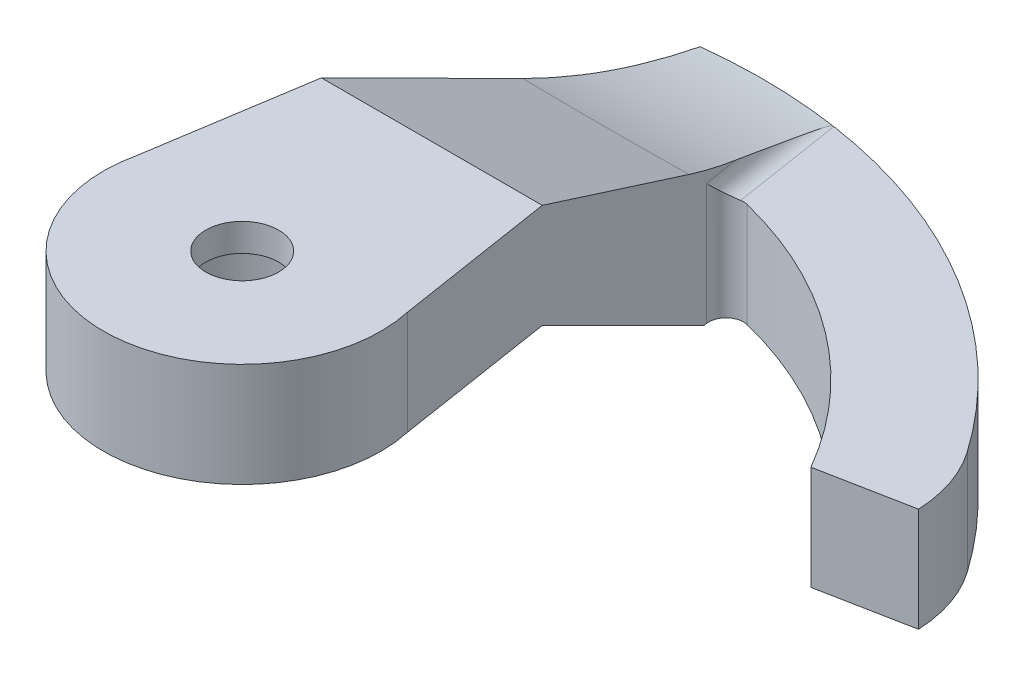
ISO-10303-21;
HEADER;
FILE_DESCRIPTION(('STEP AP214'),'2;1');
FILE_NAME('part.step','',(''),(''),'','','');
FILE_SCHEMA(('AUTOMOTIVE_DESIGN { 1 0 10303 214 1 1 1 1 }'));
ENDSEC;
DATA;
#1=APPLICATION_CONTEXT('core data for automotive mechanical design processes');
#2=APPLICATION_PROTOCOL_DEFINITION('international standard','automotive_design',2000,#1);
#3=PRODUCT_CONTEXT('',#1,'mechanical');
#4=PRODUCT('Part','Part','',(#3));
#5=PRODUCT_RELATED_PRODUCT_CATEGORY('part','',(#4));
#6=PRODUCT_DEFINITION_FORMATION('','',#4);
#7=PRODUCT_DEFINITION_CONTEXT('part definition',#1,'design');
#8=PRODUCT_DEFINITION('design','',#6,#7);
#9=PRODUCT_DEFINITION_SHAPE('','',#8);
#10=(LENGTH_UNIT() NAMED_UNIT(*) SI_UNIT(.MILLI.,.METRE.));
#11=(NAMED_UNIT(*) PLANE_ANGLE_UNIT() SI_UNIT($,.RADIAN.));
#12=(NAMED_UNIT(*) SI_UNIT($,.STERADIAN.) SOLID_ANGLE_UNIT());
#13=UNCERTAINTY_MEASURE_WITH_UNIT(LENGTH_MEASURE(1.E-05),#10,'distance_accuracy_value','');
#14=(GEOMETRIC_REPRESENTATION_CONTEXT(3) GLOBAL_UNCERTAINTY_ASSIGNED_CONTEXT((#13)) GLOBAL_UNIT_ASSIGNED_CONTEXT((#10,
#11,#12)) REPRESENTATION_CONTEXT('',''));
#15=CARTESIAN_POINT('',(0.,0.,0.));
#16=DIRECTION('',(0.,0.,1.));
#17=DIRECTION('',(1.,0.,0.));
#18=AXIS2_PLACEMENT_3D('',#15,#16,#17);
#19=CARTESIAN_POINT('',(2.,-5.7,-13.));
#20=DIRECTION('',(0.987897298785657,0.,-0.155109403493158));
#21=DIRECTION('',(-0.155109403493158,0.,-0.987897298785657));
#22=AXIS2_PLACEMENT_3D('',#19,#20,#21);
#23=PLANE('',#22);
#24=DIRECTION('',(0.,-1.,0.));
#25=VECTOR('',#24,1.);
#26=CARTESIAN_POINT('',(2.30186379785542,-5.7,-11.0774187522699));
#27=LINE('',#26,#25);
#28=CARTESIAN_POINT('',(2.30186379785542,-5.7,-11.0774187522699));
#29=VERTEX_POINT('',#28);
#30=CARTESIAN_POINT('',(2.30186379785542,-2.2,-11.0774187522699));
#31=VERTEX_POINT('',#30);
#32=EDGE_CURVE('E143',#29,#31,#27,.F.);
#33=ORIENTED_EDGE('',*,*,#32,.T.);
#34=DIRECTION('',(-0.155109403493158,0.,-0.987897298785657));
#35=VECTOR('',#34,1.);
#36=CARTESIAN_POINT('',(2.,-2.2,-13.));
#37=LINE('',#36,#35);
#38=CARTESIAN_POINT('',(2.14293288436369,-2.19999999999611,-12.0896553839383));
#39=VERTEX_POINT('',#38);
#40=EDGE_CURVE('E352',#31,#39,#37,.T.);
#41=ORIENTED_EDGE('',*,*,#40,.T.);
#42=CARTESIAN_POINT('',(-4.79752133187451,-2.7,-14.2121000935896));
#43=CARTESIAN_POINT('',(-5.13318644290078,-2.45489766446139,-12.4229081221193));
#44=CARTESIAN_POINT('',(-5.48061028243497,-1.74980033179134,-10.7627609721337));
#45=CARTESIAN_POINT('',(-4.66957807039711,-2.7,-14.2553098999343));
#46=CARTESIAN_POINT('',(-4.98275489532584,-2.45684589057673,-12.4274952080194));
#47=CARTESIAN_POINT('',(-5.30743555571062,-1.73679045887222,-10.732129309741));
#48=CARTESIAN_POINT('',(-4.5375825006336,-2.7,-14.2979229890706));
#49=CARTESIAN_POINT('',(-4.83000879640661,-2.45948374365066,-12.4337060161729));
#50=CARTESIAN_POINT('',(-5.13355004313864,-1.72536404652655,-10.7052258951182));
#51=CARTESIAN_POINT('',(-4.2666029322981,-2.7,-14.3810992926904));
#52=CARTESIAN_POINT('',(-4.52058800058379,-2.46568324812962,-12.4483027097288));
#53=CARTESIAN_POINT('',(-4.78487641736793,-1.70511022915286,-10.6575384119421));
#54=CARTESIAN_POINT('',(-4.12762269614675,-2.7,-14.4216635876764));
#55=CARTESIAN_POINT('',(-4.3639174004254,-2.46924486693202,-12.4566885183685));
#56=CARTESIAN_POINT('',(-4.61008883466798,-1.69628144206755,-10.6367510893436));
#57=CARTESIAN_POINT('',(-3.84386753885221,-2.7,-14.4998741196542));
#58=CARTESIAN_POINT('',(-4.04753328671518,-2.4768320871263,-12.4745525796807));
#59=CARTESIAN_POINT('',(-4.26021107082828,-1.68065422042625,-10.5999568961622));
#60=CARTESIAN_POINT('',(-3.69910176229509,-2.7,-14.5375247053706));
#61=CARTESIAN_POINT('',(-3.88782916350045,-2.48085708585206,-12.4840294133796));
#62=CARTESIAN_POINT('',(-4.08512175555619,-1.67385271511692,-10.5839427955101));
#63=CARTESIAN_POINT('',(-3.40440985128987,-2.7,-14.6093468722419));
#64=CARTESIAN_POINT('',(-3.56564356805643,-2.48904026006899,-12.5032966446179));
#65=CARTESIAN_POINT('',(-3.73456318690505,-1.66185087662426,-10.5556845437128));
#66=CARTESIAN_POINT('',(-3.25448293451143,-2.7,-14.6435179228311));
#67=CARTESIAN_POINT('',(-3.40316823264915,-2.49319832136314,-12.5130867732811));
#68=CARTESIAN_POINT('',(-3.55909387973761,-1.65665078738379,-10.5434409669295));
#69=CARTESIAN_POINT('',(-2.79890427974513,-2.7,-14.7398145458714));
#70=CARTESIAN_POINT('',(-2.91297122851741,-2.50542068457699,-12.5418642491209));
#71=CARTESIAN_POINT('',(-3.03321376623377,-1.6429563259312,-10.5111974452231));
#72=CARTESIAN_POINT('',(-2.4867655762965,-2.7,-14.7959168580991));
#73=CARTESIAN_POINT('',(-2.58198863640697,-2.51324686639929,-12.5602909440544));
#74=CARTESIAN_POINT('',(-2.68248917420221,-1.6363337370781,-10.4956046022203));
#75=CARTESIAN_POINT('',(-1.85071564171932,-2.7,-14.8888647108006));
#76=CARTESIAN_POINT('',(-1.91378487759617,-2.52668790765447,-12.5919377895305));
#77=CARTESIAN_POINT('',(-1.98061873083567,-1.62625520041635,-10.4718747522552));
#78=CARTESIAN_POINT('',(-1.52679893410118,-2.7,-14.9257011674186));
#79=CARTESIAN_POINT('',(-1.57664911986699,-2.53229838941505,-12.6051476328717));
#80=CARTESIAN_POINT('',(-1.62947275888573,-1.62280074580643,-10.4637412610198));
#81=CARTESIAN_POINT('',(-0.873204060730277,-2.7,-14.978144504117));
#82=CARTESIAN_POINT('',(-0.899609908576277,-2.54038939099545,-12.6241978442282));
#83=CARTESIAN_POINT('',(-0.927700263922301,-1.61807296027599,-10.4526097202942));
#84=CARTESIAN_POINT('',(-0.543536883481832,-2.7,-14.9937881596769));
#85=CARTESIAN_POINT('',(-0.559813338429111,-2.54287293749757,-12.6300453385475));
#86=CARTESIAN_POINT('',(-0.577073898452881,-1.61679585005128,-10.4496027724566));
#87=CARTESIAN_POINT('',(0.116833815050918,-2.7,-15.0031770954783));
#88=CARTESIAN_POINT('',(0.120378972612391,-2.54435585727638,-12.6335368636609));
#89=CARTESIAN_POINT('',(0.124108578102065,-1.61601406279007,-10.4477620593615));
#90=CARTESIAN_POINT('',(0.447537073331416,-2.7,-14.9969275440675));
#91=CARTESIAN_POINT('',(0.460667686978426,-2.54335558493671,-12.6311817288491));
#92=CARTESIAN_POINT('',(0.474664686233908,-1.61650896743314,-10.4489273091712));
#93=CARTESIAN_POINT('',(0.940882564694361,-2.7,-14.9713735264812));
#94=CARTESIAN_POINT('',(0.969992608903101,-2.53935751105,-12.6217682895111));
#95=CARTESIAN_POINT('',(1.00082128887623,-1.61870869746507,-10.4541065594307));
#96=CARTESIAN_POINT('',(1.10504781162355,-2.7,-14.960138892166));
#97=CARTESIAN_POINT('',(1.13972256917356,-2.53760584069683,-12.617643992893));
#98=CARTESIAN_POINT('',(1.17644229626345,-1.61968660381244,-10.4564090336571));
#99=CARTESIAN_POINT('',(1.43169991794988,-2.7,-14.9324172206366));
#100=CARTESIAN_POINT('',(1.47832940902747,-2.53334182017711,-12.6076043839124));
#101=CARTESIAN_POINT('',(1.52765570998141,-1.62221003149571,-10.4623504279618));
#102=CARTESIAN_POINT('',(1.59418680186084,-2.7,-14.915930260249));
#103=CARTESIAN_POINT('',(1.64719372028884,-2.53082979298069,-12.601689831981));
#104=CARTESIAN_POINT('',(1.70324811669291,-1.62375554452918,-10.4659893284921));
#105=CARTESIAN_POINT('',(1.91686886670933,-2.7,-14.8779027942894));
#106=CARTESIAN_POINT('',(1.98377635091646,-2.52514178915277,-12.5882974634292));
#107=CARTESIAN_POINT('',(2.05443752924195,-1.62752130873887,-10.4748557961847));
#108=CARTESIAN_POINT('',(2.07706338086897,-2.7,-14.8563608488558));
#109=CARTESIAN_POINT('',(2.15148249973104,-2.52196600967817,-12.5808201110134));
#110=CARTESIAN_POINT('',(2.23003452210995,-1.62974175221557,-10.4800838161171));
#111=CARTESIAN_POINT('',(2.39444022987948,-2.7,-14.8085284222813));
#112=CARTESIAN_POINT('',(2.48534667151388,-2.51509907482426,-12.564651956918));
#113=CARTESIAN_POINT('',(2.58115315567372,-1.63502357307548,-10.4925198294745));
#114=CARTESIAN_POINT('',(2.55162242223467,-2.7,-14.7822377171141));
#115=CARTESIAN_POINT('',(2.65149383445822,-2.511408304459,-12.5559620617515));
#116=CARTESIAN_POINT('',(2.75667479242278,-1.63808499013583,-10.4997279163189));
#117=CARTESIAN_POINT('',(2.70695427770255,-2.7,-14.7537249038481));
#118=CARTESIAN_POINT('',(2.8167189731494,-2.50753325278855,-12.5468382774331));
#119=CARTESIAN_POINT('',(2.93213553469174,-1.64164997500554,-10.5081216503425));
#120=(BOUNDED_SURFACE() B_SPLINE_SURFACE(3,2,((#42,#43,#44),(#45,#46,#47),(#48,#49,#50),(#51,
#52,#53),(#54,#55,#56),(#57,#58,#59),(#60,#61,#62),(#63,#64,#65),(#66,#67,#68),(#69,#70,#71),
(#72,#73,#74),(#75,#76,#77),(#78,#79,#80),(#81,#82,#83),(#84,#85,#86),(#87,#88,#89),(#90,#91,
#92),(#93,#94,#95),(#96,#97,#98),(#99,#100,#101),(#102,#103,#104),(#105,#106,#107),(#108,#109,
#110),(#111,#112,#113),(#114,#115,#116),(#117,#118,#119)),.UNSPECIFIED.,.F.,.F.,
.F.) B_SPLINE_SURFACE_WITH_KNOTS((4,2,2,2,2,2,2,2,2,2,2,2,4),(3,3),(0.,0.528887227038429,
1.05749255053712,1.58529307063587,2.11317395058495,3.16639930707198,4.220120812917,
5.27201146286006,6.323653808833,6.85056560928237,7.37746970285839,7.90452406233825,
8.43160329250523),(0.,1.),
.UNSPECIFIED.) GEOMETRIC_REPRESENTATION_ITEM() RATIONAL_B_SPLINE_SURFACE(((1.,0.991502525096196,
1.),(1.,0.991198306422048,1.),(1.,0.990898142102322,1.),(1.,0.990312000240389,1.),(1.,
0.990026015221729,1.),(1.,0.989474393352266,1.),(1.,0.989208726184226,1.),(1.,0.988701753868574,
1.),(1.,0.988460452436341,1.),(1.,0.987780225788079,1.),(1.,0.987383614501566,1.),(1.,
0.986726260871237,1.),(1.,0.986465582620053,1.),(1.,0.986094396309662,1.),(1.,0.985983628114614,
1.),(1.,0.985917153054352,1.),(1.,0.985961409592318,1.),(1.,0.986142311760186,1.),(1.,
0.986221840373209,1.),(1.,0.986418042866661,1.),(1.,0.986534716203767,1.),(1.,0.986803763150659,
1.),(1.,0.98695614693219,1.),(1.,0.987294407792744,1.),(1.,0.987480286451913,1.),(1.,
0.987681810723772,1.))) REPRESENTATION_ITEM('') SURFACE());
#121=CARTESIAN_POINT('',(1.7011759251195,-2.7,-14.9032211441619));
#122=CARTESIAN_POINT('',(1.76090129445513,-2.67224006413915,-14.5228281460145));
#123=CARTESIAN_POINT('',(1.82045088426288,-2.62877814873787,-14.143554693922));
#124=CARTESIAN_POINT('',(1.93841740449698,-2.51121057481243,-13.3922217375578));
#125=CARTESIAN_POINT('',(1.99683920345082,-2.43730789090149,-13.0201312254617));
#126=CARTESIAN_POINT('',(2.11256416827434,-2.25924203095393,-12.283074815105));
#127=CARTESIAN_POINT('',(2.16986731495724,-2.15507833637521,-11.9181090390459));
#128=CARTESIAN_POINT('',(2.28334921264257,-1.91636656865337,-11.1953388029438));
#129=CARTESIAN_POINT('',(2.33951803513296,-1.78162232056316,-10.8375975779466));
#130=CARTESIAN_POINT('',(2.3947349918283,-1.63221999378175,-10.4859188199988));
#131=B_SPLINE_CURVE_WITH_KNOTS('',3,(#121,#122,#123,#124,#125,#126,#127,#128,#129,#130),
.UNSPECIFIED.,.F.,.F.,(4,2,2,2,4),(0.,1.15783750004814,2.30807656907647,3.45833534936156,
4.61619279332805),.UNSPECIFIED.);
#132=CARTESIAN_POINT('',(2.3947349918283,-1.63221999378175,-10.4859188199988));
#133=VERTEX_POINT('',#132);
#134=EDGE_CURVE('E144',#39,#133,#131,.T.);
#135=ORIENTED_EDGE('',*,*,#134,.T.);
#136=DIRECTION('',(-0.143029556759345,-0.386902869437822,-0.910960325982425));
#137=VECTOR('',#136,1.);
#138=CARTESIAN_POINT('',(1.83398436222617,-3.14908149113766,-14.0573594921998));
#139=LINE('',#138,#137);
#140=CARTESIAN_POINT('',(3.18297024339712,0.5,-5.46562051250893));
#141=VERTEX_POINT('',#140);
#142=EDGE_CURVE('E223',#141,#133,#139,.T.);
#143=ORIENTED_EDGE('',*,*,#142,.F.);
#144=DIRECTION('',(-0.155109403493158,0.,-0.987897298785657));
#145=VECTOR('',#144,1.);
#146=CARTESIAN_POINT('',(2.,0.5,-13.));
#147=LINE('',#146,#145);
#148=CARTESIAN_POINT('',(3.90521460720455,0.5,-0.86562051250893));
#149=VERTEX_POINT('',#148);
#150=EDGE_CURVE('E193',#149,#141,#147,.T.);
#151=ORIENTED_EDGE('',*,*,#150,.F.);
#152=DIRECTION('',(0.,1.,0.));
#153=VECTOR('',#152,1.);
#154=CARTESIAN_POINT('',(3.90521460720455,-5.7,-0.86562051250893));
#155=LINE('',#154,#153);
#156=CARTESIAN_POINT('',(3.90521460720455,-2.5,-0.86562051250893));
#157=VERTEX_POINT('',#156);
#158=EDGE_CURVE('E200',#157,#149,#155,.T.);
#159=ORIENTED_EDGE('',*,*,#158,.F.);
#160=DIRECTION('',(0.155109403493158,0.,0.987897298785657));
#161=VECTOR('',#160,1.);
#162=CARTESIAN_POINT('',(2.,-2.5,-13.));
#163=LINE('',#162,#161);
#164=CARTESIAN_POINT('',(3.18297024339712,-2.5,-5.46562051250893));
#165=VERTEX_POINT('',#164);
#166=EDGE_CURVE('E221',#165,#157,#163,.T.);
#167=ORIENTED_EDGE('',*,*,#166,.F.);
#168=DIRECTION('',(0.134685581057554,0.495993308955759,0.857817248442992));
#169=VECTOR('',#168,1.);
#170=CARTESIAN_POINT('',(2.07725168501319,-6.57192070777256,-12.5079812749422));
#171=LINE('',#170,#169);
#172=CARTESIAN_POINT('',(2.31401928861193,-5.7,-11.));
#173=VERTEX_POINT('',#172);
#174=EDGE_CURVE('E184',#173,#165,#171,.T.);
#175=ORIENTED_EDGE('',*,*,#174,.F.);
#176=DIRECTION('',(-0.155109403493158,0.,-0.987897298785657));
#177=VECTOR('',#176,1.);
#178=CARTESIAN_POINT('',(2.,-5.7,-13.));
#179=LINE('',#178,#177);
#180=EDGE_CURVE('E194',#173,#29,#179,.T.);
#181=ORIENTED_EDGE('',*,*,#180,.T.);
#182=EDGE_LOOP('',(#33,#41,#135,#143,#151,#159,#167,#175,#181));
#183=FACE_BOUND('',#182,.T.);
#184=ADVANCED_FACE('F35',(#183),#23,.T.);
#185=CARTESIAN_POINT('',(0.,0.5,0.));
#186=DIRECTION('',(0.,1.,0.));
#187=DIRECTION('',(0.,0.,1.));
#188=AXIS2_PLACEMENT_3D('',#185,#186,#187);
#189=PLANE('',#188);
#190=DIRECTION('',(1.,0.,0.));
#191=VECTOR('',#190,1.);
#192=CARTESIAN_POINT('',(-6.5,0.5,-5.46562051250893));
#193=LINE('',#192,#191);
#194=CARTESIAN_POINT('',(-3.18297024339712,0.5,-5.46562051250893));
#195=VERTEX_POINT('',#194);
#196=EDGE_CURVE('E175',#195,#141,#193,.T.);
#197=ORIENTED_EDGE('',*,*,#196,.F.);
#198=DIRECTION('',(-0.155109403493158,0.,0.987897298785657));
#199=VECTOR('',#198,1.);
#200=CARTESIAN_POINT('',(-3.90521460720455,0.5,-0.86562051250893));
#201=LINE('',#200,#199);
#202=CARTESIAN_POINT('',(-3.90521460720455,0.5,-0.86562051250893));
#203=VERTEX_POINT('',#202);
#204=EDGE_CURVE('E198',#195,#203,#201,.T.);
#205=ORIENTED_EDGE('',*,*,#204,.T.);
#206=CARTESIAN_POINT('',(0.,0.5,0.));
#207=DIRECTION('',(0.,1.,0.));
#208=DIRECTION('',(0.,0.,1.));
#209=AXIS2_PLACEMENT_3D('',#206,#207,#208);
#210=CIRCLE('',#209,4.);
#211=EDGE_CURVE('E218',#203,#149,#210,.T.);
#212=ORIENTED_EDGE('',*,*,#211,.T.);
#213=ORIENTED_EDGE('',*,*,#150,.T.);
#214=EDGE_LOOP('',(#197,#205,#212,#213));
#215=FACE_BOUND('',#214,.T.);
#216=CARTESIAN_POINT('',(0.,0.5,0.));
#217=DIRECTION('',(0.,1.,0.));
#218=DIRECTION('',(0.,0.,1.));
#219=AXIS2_PLACEMENT_3D('',#216,#217,#218);
#220=CIRCLE('',#219,1.05);
#221=CARTESIAN_POINT('',(0.,0.5,1.05));
#222=VERTEX_POINT('',#221);
#223=EDGE_CURVE('E215',#222,#222,#220,.T.);
#224=ORIENTED_EDGE('',*,*,#223,.F.);
#225=EDGE_LOOP('',(#224));
#226=FACE_BOUND('',#225,.T.);
#227=ADVANCED_FACE('F302',(#215,#226),#189,.T.);
#228=CARTESIAN_POINT('',(0.,0.5,0.));
#229=DIRECTION('',(0.,-1.,0.));
#230=DIRECTION('',(0.,0.,-1.));
#231=AXIS2_PLACEMENT_3D('',#228,#229,#230);
#232=CYLINDRICAL_SURFACE('',#231,4.);
#233=ORIENTED_EDGE('',*,*,#211,.F.);
#234=DIRECTION('',(0.,1.,0.));
#235=VECTOR('',#234,1.);
#236=CARTESIAN_POINT('',(-3.90521460720455,-5.7,-0.86562051250893));
#237=LINE('',#236,#235);
#238=CARTESIAN_POINT('',(-3.90521460720455,-2.5,-0.86562051250893));
#239=VERTEX_POINT('',#238);
#240=EDGE_CURVE('E204',#239,#203,#237,.T.);
#241=ORIENTED_EDGE('',*,*,#240,.F.);
#242=CARTESIAN_POINT('',(0.,-2.5,0.));
#243=DIRECTION('',(0.,-1.,0.));
#244=DIRECTION('',(0.,0.,-1.));
#245=AXIS2_PLACEMENT_3D('',#242,#243,#244);
#246=CIRCLE('',#245,4.);
#247=EDGE_CURVE('E212',#157,#239,#246,.T.);
#248=ORIENTED_EDGE('',*,*,#247,.F.);
#249=ORIENTED_EDGE('',*,*,#158,.T.);
#250=EDGE_LOOP('',(#233,#241,#248,#249));
#251=FACE_BOUND('',#250,.T.);
#252=ADVANCED_FACE('F307',(#251),#232,.T.);
#253=CARTESIAN_POINT('',(0.,0.5,0.));
#254=DIRECTION('',(0.,-1.,0.));
#255=DIRECTION('',(0.,0.,-1.));
#256=AXIS2_PLACEMENT_3D('',#253,#254,#255);
#257=CYLINDRICAL_SURFACE('',#256,1.05);
#258=ORIENTED_EDGE('',*,*,#223,.T.);
#259=EDGE_LOOP('',(#258));
#260=FACE_BOUND('',#259,.T.);
#261=CARTESIAN_POINT('',(0.,-0.3,0.));
#262=DIRECTION('',(0.,-1.,0.));
#263=DIRECTION('',(0.,0.,-1.));
#264=AXIS2_PLACEMENT_3D('',#261,#262,#263);
#265=CIRCLE('',#264,1.05);
#266=CARTESIAN_POINT('',(0.,-0.3,-1.05));
#267=VERTEX_POINT('',#266);
#268=EDGE_CURVE('E163',#267,#267,#265,.T.);
#269=ORIENTED_EDGE('',*,*,#268,.T.);
#270=EDGE_LOOP('',(#269));
#271=FACE_BOUND('',#270,.T.);
#272=ADVANCED_FACE('F294',(#260,#271),#257,.F.);
#273=CARTESIAN_POINT('',(0.,-2.5,0.));
#274=DIRECTION('',(0.,-1.,0.));
#275=DIRECTION('',(0.,0.,-1.));
#276=AXIS2_PLACEMENT_3D('',#273,#274,#275);
#277=PLANE('',#276);
#278=DIRECTION('',(1.,0.,0.));
#279=VECTOR('',#278,1.);
#280=CARTESIAN_POINT('',(-6.5,-2.5,-5.46562051250893));
#281=LINE('',#280,#279);
#282=CARTESIAN_POINT('',(-3.18297024339712,-2.5,-5.46562051250893));
#283=VERTEX_POINT('',#282);
#284=EDGE_CURVE('E181',#283,#165,#281,.T.);
#285=ORIENTED_EDGE('',*,*,#284,.T.);
#286=ORIENTED_EDGE('',*,*,#166,.T.);
#287=ORIENTED_EDGE('',*,*,#247,.T.);
#288=DIRECTION('',(0.155109403493158,0.,-0.987897298785657));
#289=VECTOR('',#288,1.);
#290=CARTESIAN_POINT('',(-3.90521460720455,-2.5,-0.86562051250893));
#291=LINE('',#290,#289);
#292=EDGE_CURVE('E191',#239,#283,#291,.T.);
#293=ORIENTED_EDGE('',*,*,#292,.T.);
#294=EDGE_LOOP('',(#285,#286,#287,#293));
#295=FACE_BOUND('',#294,.T.);
#296=CARTESIAN_POINT('',(0.,-2.5,0.));
#297=DIRECTION('',(0.,-1.,0.));
#298=DIRECTION('',(0.,0.,-1.));
#299=AXIS2_PLACEMENT_3D('',#296,#297,#298);
#300=CIRCLE('',#299,2.45);
#301=CARTESIAN_POINT('',(0.,-2.5,-2.45));
#302=VERTEX_POINT('',#301);
#303=EDGE_CURVE('E207',#302,#302,#300,.T.);
#304=ORIENTED_EDGE('',*,*,#303,.F.);
#305=EDGE_LOOP('',(#304));
#306=FACE_BOUND('',#305,.T.);
#307=ADVANCED_FACE('F318',(#295,#306),#277,.T.);
#308=CARTESIAN_POINT('',(0.,-2.5,0.));
#309=DIRECTION('',(0.,1.,0.));
#310=DIRECTION('',(0.,0.,1.));
#311=AXIS2_PLACEMENT_3D('',#308,#309,#310);
#312=CYLINDRICAL_SURFACE('',#311,2.45);
#313=CARTESIAN_POINT('',(0.,-0.3,0.));
#314=DIRECTION('',(0.,-1.,0.));
#315=DIRECTION('',(0.,0.,-1.));
#316=AXIS2_PLACEMENT_3D('',#313,#314,#315);
#317=CIRCLE('',#316,2.45);
#318=CARTESIAN_POINT('',(0.,-0.3,-2.45));
#319=VERTEX_POINT('',#318);
#320=EDGE_CURVE('E11',#319,#319,#317,.T.);
#321=ORIENTED_EDGE('',*,*,#320,.F.);
#322=EDGE_LOOP('',(#321));
#323=FACE_BOUND('',#322,.T.);
#324=ORIENTED_EDGE('',*,*,#303,.T.);
#325=EDGE_LOOP('',(#324));
#326=FACE_BOUND('',#325,.T.);
#327=ADVANCED_FACE('F315',(#323,#326),#312,.F.);
#328=CARTESIAN_POINT('',(-3.90521460720455,-5.7,-0.86562051250893));
#329=DIRECTION('',(-0.987897298785657,0.,-0.155109403493158));
#330=DIRECTION('',(-0.155109403493158,0.,0.987897298785657));
#331=AXIS2_PLACEMENT_3D('',#328,#329,#330);
#332=PLANE('',#331);
#333=DIRECTION('',(-0.155109403493158,0.,0.987897298785657));
#334=VECTOR('',#333,1.);
#335=CARTESIAN_POINT('',(-3.90521460720455,-5.7,-0.86562051250893));
#336=LINE('',#335,#334);
#337=CARTESIAN_POINT('',(-1.70117592511957,-5.7,-14.9032211441619));
#338=VERTEX_POINT('',#337);
#339=CARTESIAN_POINT('',(-2.31401928861193,-5.7,-11.));
#340=VERTEX_POINT('',#339);
#341=EDGE_CURVE('E197',#338,#340,#336,.T.);
#342=ORIENTED_EDGE('',*,*,#341,.T.);
#343=DIRECTION('',(0.134685581057554,-0.495993308955759,-0.857817248442992));
#344=VECTOR('',#343,1.);
#345=CARTESIAN_POINT('',(-3.51376566121863,-1.28181233221554,-3.3587727498524));
#346=LINE('',#345,#344);
#347=EDGE_CURVE('E188',#283,#340,#346,.T.);
#348=ORIENTED_EDGE('',*,*,#347,.F.);
#349=ORIENTED_EDGE('',*,*,#292,.F.);
#350=ORIENTED_EDGE('',*,*,#240,.T.);
#351=ORIENTED_EDGE('',*,*,#204,.F.);
#352=DIRECTION('',(-0.143029556759345,0.386902869437822,0.910960325982425));
#353=VECTOR('',#352,1.);
#354=CARTESIAN_POINT('',(-3.45400009718383,1.23315075925061,-3.73942174946635));
#355=LINE('',#354,#353);
#356=CARTESIAN_POINT('',(-2.3947349918283,-1.63221999378175,-10.4859188199988));
#357=VERTEX_POINT('',#356);
#358=EDGE_CURVE('E140',#357,#195,#355,.T.);
#359=ORIENTED_EDGE('',*,*,#358,.F.);
#360=CARTESIAN_POINT('',(-2.3947349918283,-1.63221999378175,-10.4859188199988));
#361=CARTESIAN_POINT('',(-2.33951803320332,-1.78162221608531,-10.8375975902365));
#362=CARTESIAN_POINT('',(-2.28334921505604,-1.91636672364633,-11.1953387875723));
#363=CARTESIAN_POINT('',(-2.16986731939579,-2.15507886552563,-11.9181090107766));
#364=CARTESIAN_POINT('',(-2.11256417046988,-2.25924267621586,-12.2830748011216));
#365=CARTESIAN_POINT('',(-1.99683918484862,-2.43730776048541,-13.0201313439397));
#366=CARTESIAN_POINT('',(-1.93841736755204,-2.51120955834019,-13.3922219728615));
#367=CARTESIAN_POINT('',(-1.82045083436971,-2.6287763678734,-14.1435550116935));
#368=CARTESIAN_POINT('',(-1.76090125010847,-2.67223841113585,-14.5228284284601));
#369=CARTESIAN_POINT('',(-1.70117592511956,-2.7,-14.9032211441619));
#370=B_SPLINE_CURVE_WITH_KNOTS('',3,(#360,#361,#362,#363,#364,#365,#366,#367,#368,#369),
.UNSPECIFIED.,.F.,.F.,(4,2,2,2,4),(0.,1.15785754602695,2.30811640830878,3.45835534204129,
4.61619272426522),.UNSPECIFIED.);
#371=CARTESIAN_POINT('',(-1.70117592511957,-2.7,-14.9032211441619));
#372=VERTEX_POINT('',#371);
#373=EDGE_CURVE('E135',#357,#372,#370,.T.);
#374=ORIENTED_EDGE('',*,*,#373,.T.);
#375=DIRECTION('',(0.,-1.,0.));
#376=VECTOR('',#375,1.);
#377=CARTESIAN_POINT('',(-1.70117592511957,-2.7,-14.9032211441619));
#378=LINE('',#377,#376);
#379=EDGE_CURVE('E137',#372,#338,#378,.T.);
#380=ORIENTED_EDGE('',*,*,#379,.T.);
#381=EDGE_LOOP('',(#342,#348,#349,#350,#351,#359,#374,#380));
#382=FACE_BOUND('',#381,.T.);
#383=ADVANCED_FACE('F136',(#382),#332,.T.);
#384=CARTESIAN_POINT('',(0.,-5.7,0.));
#385=DIRECTION('',(0.,-1.,0.));
#386=DIRECTION('',(0.,0.,-1.));
#387=AXIS2_PLACEMENT_3D('',#384,#385,#386);
#388=PLANE('',#387);
#389=CARTESIAN_POINT('',(0.,-5.7,0.));
#390=DIRECTION('',(0.,-1.,0.));
#391=DIRECTION('',(0.,0.,-1.));
#392=AXIS2_PLACEMENT_3D('',#389,#390,#391);
#393=CIRCLE('',#392,15.);
#394=CARTESIAN_POINT('',(12.2642213479057,-5.7,-8.6364850911453));
#395=VERTEX_POINT('',#394);
#396=EDGE_CURVE('E149',#338,#395,#393,.T.);
#397=ORIENTED_EDGE('',*,*,#396,.T.);
#398=CARTESIAN_POINT('',(8.99376232179748,-5.7,-6.33342240017322));
#399=DIRECTION('',(0.,-1.,0.));
#400=DIRECTION('',(0.,0.,-1.));
#401=AXIS2_PLACEMENT_3D('',#398,#399,#400);
#402=CIRCLE('',#401,4.);
#403=CARTESIAN_POINT('',(12.9900826209631,-5.7,-6.5049568470825));
#404=VERTEX_POINT('',#403);
#405=EDGE_CURVE('E228',#395,#404,#402,.T.);
#406=ORIENTED_EDGE('',*,*,#405,.T.);
#407=DIRECTION('',(0.981627183447664,0.,-0.190808995376546));
#408=VECTOR('',#407,1.);
#409=CARTESIAN_POINT('',(10.3923048454133,-5.7,-6.00000000000002));
#410=LINE('',#409,#408);
#411=CARTESIAN_POINT('',(10.3923048454133,-5.7,-6.00000000000002));
#412=VERTEX_POINT('',#411);
#413=EDGE_CURVE('E167',#412,#404,#410,.T.);
#414=ORIENTED_EDGE('',*,*,#413,.F.);
#415=CARTESIAN_POINT('',(0.,-5.7,0.));
#416=DIRECTION('',(0.,-1.,0.));
#417=DIRECTION('',(0.,0.,-1.));
#418=AXIS2_PLACEMENT_3D('',#415,#416,#417);
#419=CIRCLE('',#418,12.);
#420=CARTESIAN_POINT('',(2.91736951017209,-5.7,-11.6399722998433));
#421=VERTEX_POINT('',#420);
#422=EDGE_CURVE('E161',#421,#412,#419,.T.);
#423=ORIENTED_EDGE('',*,*,#422,.F.);
#424=CARTESIAN_POINT('',(2.79581244724825,-5.7,-11.1549734540165));
#425=DIRECTION('',(0.,-1.,0.));
#426=DIRECTION('',(0.,0.,-1.));
#427=AXIS2_PLACEMENT_3D('',#424,#425,#426);
#428=CIRCLE('',#427,0.5);
#429=EDGE_CURVE('E43',#421,#29,#428,.F.);
#430=ORIENTED_EDGE('',*,*,#429,.T.);
#431=ORIENTED_EDGE('',*,*,#180,.F.);
#432=DIRECTION('',(1.,0.,0.));
#433=VECTOR('',#432,1.);
#434=CARTESIAN_POINT('',(-6.5,-5.7,-11.));
#435=LINE('',#434,#433);
#436=EDGE_CURVE('E180',#340,#173,#435,.T.);
#437=ORIENTED_EDGE('',*,*,#436,.F.);
#438=ORIENTED_EDGE('',*,*,#341,.F.);
#439=EDGE_LOOP('',(#397,#406,#414,#423,#430,#431,#437,#438));
#440=FACE_BOUND('',#439,.T.);
#441=ADVANCED_FACE('F345',(#440),#388,.T.);
#442=CARTESIAN_POINT('',(-6.5,-2.5,-5.46562051250893));
#443=DIRECTION('',(0.,0.865705219919018,-0.500554165105999));
#444=DIRECTION('',(0.,0.500554165105999,0.865705219919019));
#445=AXIS2_PLACEMENT_3D('',#442,#443,#444);
#446=PLANE('',#445);
#447=ORIENTED_EDGE('',*,*,#347,.T.);
#448=ORIENTED_EDGE('',*,*,#436,.T.);
#449=ORIENTED_EDGE('',*,*,#174,.T.);
#450=ORIENTED_EDGE('',*,*,#284,.F.);
#451=EDGE_LOOP('',(#447,#448,#449,#450));
#452=FACE_BOUND('',#451,.T.);
#453=ADVANCED_FACE('F339',(#452),#446,.F.);
#454=CARTESIAN_POINT('',(-6.5,-2.7,-13.));
#455=DIRECTION('',(0.,-0.920423738607019,0.390922167967844));
#456=DIRECTION('',(0.,-0.390922167967844,-0.920423738607019));
#457=AXIS2_PLACEMENT_3D('',#454,#455,#456);
#458=PLANE('',#457);
#459=ORIENTED_EDGE('',*,*,#142,.T.);
#460=CARTESIAN_POINT('',(2.93213553469174,-1.64164997500554,-10.5081216503425));
#461=CARTESIAN_POINT('',(2.75667479242278,-1.63808499013583,-10.4997279163189));
#462=CARTESIAN_POINT('',(2.58115315567372,-1.63502357307548,-10.4925198294745));
#463=CARTESIAN_POINT('',(2.23003452210994,-1.62974175221557,-10.4800838161171));
#464=CARTESIAN_POINT('',(2.05443752924195,-1.62752130873887,-10.4748557961847));
#465=CARTESIAN_POINT('',(1.70324811669291,-1.62375554452918,-10.4659893284921));
#466=CARTESIAN_POINT('',(1.52765570998141,-1.62221003149571,-10.4623504279618));
#467=CARTESIAN_POINT('',(1.17644229626345,-1.61968660381244,-10.4564090336571));
#468=CARTESIAN_POINT('',(1.00082128887623,-1.61870869746507,-10.4541065594307));
#469=CARTESIAN_POINT('',(0.474664686233908,-1.61650896743314,-10.4489273091712));
#470=CARTESIAN_POINT('',(0.124108578102065,-1.61601406279007,-10.4477620593615));
#471=CARTESIAN_POINT('',(-0.577073898452881,-1.61679585005128,-10.4496027724566));
#472=CARTESIAN_POINT('',(-0.927700263922301,-1.61807296027599,-10.4526097202942));
#473=CARTESIAN_POINT('',(-1.62947275888573,-1.62280074580643,-10.4637412610198));
#474=CARTESIAN_POINT('',(-1.98061873083567,-1.62625520041635,-10.4718747522552));
#475=CARTESIAN_POINT('',(-2.68248917420221,-1.6363337370781,-10.4956046022203));
#476=CARTESIAN_POINT('',(-3.03321376623377,-1.6429563259312,-10.5111974452231));
#477=CARTESIAN_POINT('',(-3.55909387973761,-1.65665078738379,-10.5434409669295));
#478=CARTESIAN_POINT('',(-3.73456318690505,-1.66185087662426,-10.5556845437128));
#479=CARTESIAN_POINT('',(-4.08512175555619,-1.67385271511692,-10.5839427955101));
#480=CARTESIAN_POINT('',(-4.26021107082828,-1.68065422042625,-10.5999568961622));
#481=CARTESIAN_POINT('',(-4.61008883466798,-1.69628144206755,-10.6367510893436));
#482=CARTESIAN_POINT('',(-4.78487641736793,-1.70511022915286,-10.6575384119421));
#483=CARTESIAN_POINT('',(-5.13355004313864,-1.72536404652655,-10.7052258951182));
#484=CARTESIAN_POINT('',(-5.30743555571062,-1.73679045887222,-10.732129309741));
#485=CARTESIAN_POINT('',(-5.48061028243497,-1.74980033179134,-10.7627609721337));
#486=B_SPLINE_CURVE_WITH_KNOTS('',3,(#460,#461,#462,#463,#464,#465,#466,#467,#468,#469,#470,
#471,#472,#473,#474,#475,#476,#477,#478,#479,#480,#481,#482,#483,#484,#485),.UNSPECIFIED.,.F.,
.F.,(4,2,2,2,2,2,2,2,2,2,2,2,4),(0.,0.527079230166986,1.05413358964684,1.58103768322286,
2.10794948367224,3.15959182964517,4.21148247958823,5.26520398543326,6.31842934192028,
6.84631022186936,7.37411074196811,7.9027160654668,8.43160329250523),.UNSPECIFIED.);
#487=EDGE_CURVE('E233',#133,#357,#486,.T.);
#488=ORIENTED_EDGE('',*,*,#487,.T.);
#489=ORIENTED_EDGE('',*,*,#358,.T.);
#490=ORIENTED_EDGE('',*,*,#196,.T.);
#491=EDGE_LOOP('',(#459,#488,#489,#490));
#492=FACE_BOUND('',#491,.T.);
#493=ADVANCED_FACE('F245',(#492),#458,.F.);
#494=CARTESIAN_POINT('',(0.,-2.7,0.));
#495=DIRECTION('',(0.,-1.,0.));
#496=DIRECTION('',(0.,0.,-1.));
#497=AXIS2_PLACEMENT_3D('',#494,#495,#496);
#498=CYLINDRICAL_SURFACE('',#497,12.);
#499=CARTESIAN_POINT('',(0.,-2.7,0.));
#500=DIRECTION('',(0.,-1.,0.));
#501=DIRECTION('',(0.,0.,-1.));
#502=AXIS2_PLACEMENT_3D('',#499,#500,#501);
#503=CIRCLE('',#502,12.);
#504=CARTESIAN_POINT('',(2.91736951017209,-2.7,-11.6399722998433));
#505=VERTEX_POINT('',#504);
#506=CARTESIAN_POINT('',(10.3923048454133,-2.7,-6.00000000000002));
#507=VERTEX_POINT('',#506);
#508=EDGE_CURVE('E151',#505,#507,#503,.T.);
#509=ORIENTED_EDGE('',*,*,#508,.F.);
#510=DIRECTION('',(0.,-1.,0.));
#511=VECTOR('',#510,1.);
#512=CARTESIAN_POINT('',(2.91736951017209,-2.7,-11.6399722998433));
#513=LINE('',#512,#511);
#514=EDGE_CURVE('E285',#505,#421,#513,.T.);
#515=ORIENTED_EDGE('',*,*,#514,.T.);
#516=ORIENTED_EDGE('',*,*,#422,.T.);
#517=DIRECTION('',(0.,-1.,0.));
#518=VECTOR('',#517,1.);
#519=CARTESIAN_POINT('',(10.3923048454133,-2.7,-6.00000000000002));
#520=LINE('',#519,#518);
#521=EDGE_CURVE('E172',#507,#412,#520,.T.);
#522=ORIENTED_EDGE('',*,*,#521,.F.);
#523=EDGE_LOOP('',(#509,#515,#516,#522));
#524=FACE_BOUND('',#523,.T.);
#525=ADVANCED_FACE('F355',(#524),#498,.F.);
#526=CARTESIAN_POINT('',(10.3923048454133,-2.7,-6.00000000000002));
#527=DIRECTION('',(-0.190808995376546,0.,-0.981627183447664));
#528=DIRECTION('',(-0.981627183447664,0.,0.190808995376546));
#529=AXIS2_PLACEMENT_3D('',#526,#527,#528);
#530=PLANE('',#529);
#531=ORIENTED_EDGE('',*,*,#413,.T.);
#532=DIRECTION('',(0.,-1.,0.));
#533=VECTOR('',#532,1.);
#534=CARTESIAN_POINT('',(12.9900826209631,-2.7,-6.5049568470825));
#535=LINE('',#534,#533);
#536=CARTESIAN_POINT('',(12.9900826209631,-2.7,-6.5049568470825));
#537=VERTEX_POINT('',#536);
#538=EDGE_CURVE('E150',#537,#404,#535,.T.);
#539=ORIENTED_EDGE('',*,*,#538,.F.);
#540=DIRECTION('',(0.981627183447664,0.,-0.190808995376546));
#541=VECTOR('',#540,1.);
#542=CARTESIAN_POINT('',(10.3923048454133,-2.7,-6.00000000000002));
#543=LINE('',#542,#541);
#544=EDGE_CURVE('E157',#507,#537,#543,.T.);
#545=ORIENTED_EDGE('',*,*,#544,.F.);
#546=ORIENTED_EDGE('',*,*,#521,.T.);
#547=EDGE_LOOP('',(#531,#539,#545,#546));
#548=FACE_BOUND('',#547,.T.);
#549=ADVANCED_FACE('F363',(#548),#530,.F.);
#550=CARTESIAN_POINT('',(0.,-2.7,0.));
#551=DIRECTION('',(0.,-1.,0.));
#552=DIRECTION('',(0.,0.,-1.));
#553=AXIS2_PLACEMENT_3D('',#550,#551,#552);
#554=CYLINDRICAL_SURFACE('',#553,15.);
#555=CARTESIAN_POINT('',(0.,-2.7,0.));
#556=DIRECTION('',(0.,-1.,0.));
#557=DIRECTION('',(0.,0.,-1.));
#558=AXIS2_PLACEMENT_3D('',#555,#556,#557);
#559=CIRCLE('',#558,15.);
#560=CARTESIAN_POINT('',(2.21799547829129,-2.7,-14.8351102475944));
#561=VERTEX_POINT('',#560);
#562=EDGE_CURVE('E50',#372,#561,#559,.T.);
#563=ORIENTED_EDGE('',*,*,#562,.T.);
#564=CARTESIAN_POINT('',(12.2642213479057,-2.7,-8.6364850911453));
#565=VERTEX_POINT('',#564);
#566=EDGE_CURVE('E158',#561,#565,#559,.T.);
#567=ORIENTED_EDGE('',*,*,#566,.T.);
#568=DIRECTION('',(0.,-1.,0.));
#569=VECTOR('',#568,1.);
#570=CARTESIAN_POINT('',(12.2642213479057,-2.7,-8.6364850911453));
#571=LINE('',#570,#569);
#572=EDGE_CURVE('E226',#565,#395,#571,.T.);
#573=ORIENTED_EDGE('',*,*,#572,.T.);
#574=ORIENTED_EDGE('',*,*,#396,.F.);
#575=ORIENTED_EDGE('',*,*,#379,.F.);
#576=EDGE_LOOP('',(#563,#567,#573,#574,#575));
#577=FACE_BOUND('',#576,.T.);
#578=ADVANCED_FACE('F146',(#577),#554,.T.);
#579=CARTESIAN_POINT('',(0.,-2.7,0.));
#580=DIRECTION('',(0.,-1.,0.));
#581=DIRECTION('',(0.,0.,-1.));
#582=AXIS2_PLACEMENT_3D('',#579,#580,#581);
#583=PLANE('',#582);
#584=ORIENTED_EDGE('',*,*,#566,.F.);
#585=DIRECTION('',(-0.155109403493158,0.,-0.987897298785657));
#586=VECTOR('',#585,1.);
#587=CARTESIAN_POINT('',(4.43784888474171,-2.7,-0.696785074876911));
#588=LINE('',#587,#586);
#589=CARTESIAN_POINT('',(2.71825774550167,-2.7,-11.6489221034093));
#590=VERTEX_POINT('',#589);
#591=EDGE_CURVE('E57',#561,#590,#588,.F.);
#592=ORIENTED_EDGE('',*,*,#591,.T.);
#593=CARTESIAN_POINT('',(2.79581244724825,-2.7,-11.1549734540165));
#594=DIRECTION('',(0.,-1.,0.));
#595=DIRECTION('',(0.,0.,-1.));
#596=AXIS2_PLACEMENT_3D('',#593,#594,#595);
#597=CIRCLE('',#596,0.5);
#598=EDGE_CURVE('E284',#590,#505,#597,.T.);
#599=ORIENTED_EDGE('',*,*,#598,.T.);
#600=ORIENTED_EDGE('',*,*,#508,.T.);
#601=ORIENTED_EDGE('',*,*,#544,.T.);
#602=CARTESIAN_POINT('',(8.99376232179748,-2.7,-6.33342240017322));
#603=DIRECTION('',(0.,-1.,0.));
#604=DIRECTION('',(0.,0.,-1.));
#605=AXIS2_PLACEMENT_3D('',#602,#603,#604);
#606=CIRCLE('',#605,4.);
#607=EDGE_CURVE('E230',#537,#565,#606,.F.);
#608=ORIENTED_EDGE('',*,*,#607,.T.);
#609=EDGE_LOOP('',(#584,#592,#599,#600,#601,#608));
#610=FACE_BOUND('',#609,.T.);
#611=ADVANCED_FACE('F358',(#610),#583,.F.);
#612=CARTESIAN_POINT('',(8.99376232179748,-2.7,-6.33342240017322));
#613=DIRECTION('',(0.,1.,0.));
#614=DIRECTION('',(0.,0.,1.));
#615=AXIS2_PLACEMENT_3D('',#612,#613,#614);
#616=CYLINDRICAL_SURFACE('',#615,4.);
#617=ORIENTED_EDGE('',*,*,#607,.F.);
#618=ORIENTED_EDGE('',*,*,#538,.T.);
#619=ORIENTED_EDGE('',*,*,#405,.F.);
#620=ORIENTED_EDGE('',*,*,#572,.F.);
#621=EDGE_LOOP('',(#617,#618,#619,#620));
#622=FACE_BOUND('',#621,.T.);
#623=ADVANCED_FACE('F251',(#622),#616,.T.);
#624=ORIENTED_EDGE('',*,*,#373,.F.);
#625=ORIENTED_EDGE('',*,*,#487,.F.);
#626=ORIENTED_EDGE('',*,*,#134,.F.);
#627=CARTESIAN_POINT('',(2.14293288436369,-2.2,-12.0896553839383));
#628=CARTESIAN_POINT('',(2.13046816575559,-2.22277314663444,-12.1691718231564));
#629=CARTESIAN_POINT('',(2.1194735850781,-2.24489662090023,-12.2490913426071));
#630=CARTESIAN_POINT('',(2.10007707123808,-2.28779283638965,-12.4095898447849));
#631=CARTESIAN_POINT('',(2.09167463871352,-2.30856583716468,-12.4901686974213));
#632=CARTESIAN_POINT('',(2.07711575176776,-2.34870338449489,-12.651808918616));
#633=CARTESIAN_POINT('',(2.07095760738808,-2.36806898199659,-12.7328698772042));
#634=CARTESIAN_POINT('',(2.06063732716394,-2.40538258382068,-12.8954443371046));
#635=CARTESIAN_POINT('',(2.0564752462672,-2.42333054910705,-12.9769578508123));
#636=CARTESIAN_POINT('',(2.04931589659061,-2.46118998264869,-13.1564999817604));
#637=CARTESIAN_POINT('',(2.04671110403453,-2.48078901635681,-13.2546103562064));
#638=CARTESIAN_POINT('',(2.04391957743075,-2.51790243907384,-13.4512556572595));
#639=CARTESIAN_POINT('',(2.04373286947834,-2.53541680558359,-13.5497905884367));
#640=CARTESIAN_POINT('',(2.04607430788558,-2.57381259428108,-13.7799615718648));
#641=CARTESIAN_POINT('',(2.04952424072702,-2.59388173875785,-13.9117277035208));
#642=CARTESIAN_POINT('',(2.05969545344486,-2.62424340073357,-14.1317602576848));
#643=CARTESIAN_POINT('',(2.06495108861212,-2.63557010844607,-14.2199503909513));
#644=CARTESIAN_POINT('',(2.07686666517394,-2.6531003153931,-14.3671892316463));
#645=CARTESIAN_POINT('',(2.08249267596056,-2.6597618767093,-14.4262616054282));
#646=CARTESIAN_POINT('',(2.09441324161066,-2.67028668838088,-14.5249197837302));
#647=CARTESIAN_POINT('',(2.09989122787522,-2.67435396976472,-14.5645771034477));
#648=CARTESIAN_POINT('',(2.11118912101428,-2.68089527200973,-14.6308581786625));
#649=CARTESIAN_POINT('',(2.11633522659948,-2.68346174151968,-14.6575807062211));
#650=CARTESIAN_POINT('',(2.12681129633893,-2.68764900277246,-14.7022718630771));
#651=CARTESIAN_POINT('',(2.13157953573786,-2.68931435367154,-14.7203624405956));
#652=CARTESIAN_POINT('',(2.14124128032083,-2.69206499327688,-14.7506404521503));
#653=CARTESIAN_POINT('',(2.14566468772494,-2.69317394386135,-14.7629650659693));
#654=CARTESIAN_POINT('',(2.15373625841002,-2.69483305255663,-14.7814909215597));
#655=CARTESIAN_POINT('',(2.15682368169679,-2.69540819641669,-14.7879303637289));
#656=CARTESIAN_POINT('',(2.16372516919469,-2.69652703743623,-14.8004071212724));
#657=CARTESIAN_POINT('',(2.16753632097082,-2.69707084962266,-14.8064459217843));
#658=CARTESIAN_POINT('',(2.17371047550035,-2.69779432513711,-14.8143986259402));
#659=CARTESIAN_POINT('',(2.1756172081905,-2.69800098479545,-14.8166597802398));
#660=CARTESIAN_POINT('',(2.17967861466388,-2.69839909412457,-14.8209580510657));
#661=CARTESIAN_POINT('',(2.18183357039203,-2.69859052607343,-14.8229949075849));
#662=CARTESIAN_POINT('',(2.18644434449173,-2.69895192037948,-14.826780533947));
#663=CARTESIAN_POINT('',(2.18890403626745,-2.69912153525282,-14.8285247506319));
#664=CARTESIAN_POINT('',(2.19411301473521,-2.69942410027028,-14.8315077696691));
#665=CARTESIAN_POINT('',(2.19686116338212,-2.69955718752824,-14.8327484707081));
#666=CARTESIAN_POINT('',(2.20182864703747,-2.69974599147247,-14.8343593865459));
#667=CARTESIAN_POINT('',(2.20400159498527,-2.6998128098992,-14.8348715730878));
#668=CARTESIAN_POINT('',(2.20840441213483,-2.69991628271256,-14.8355047420543));
#669=CARTESIAN_POINT('',(2.21063427625263,-2.69995293978364,-14.8356257592971));
#670=CARTESIAN_POINT('',(2.21457944393523,-2.69999199470678,-14.8355199401998));
#671=CARTESIAN_POINT('',(2.21629687262391,-2.7000002726003,-14.8353656994881));
#672=CARTESIAN_POINT('',(2.21799547829188,-2.7,-14.8351102476161));
#673=B_SPLINE_CURVE_WITH_KNOTS('',3,(#627,#628,#629,#630,#631,#632,#633,#634,#635,#636,#637,
#638,#639,#640,#641,#642,#643,#644,#645,#646,#647,#648,#649,#650,#651,#652,#653,#654,#655,#656,
#657,#658,#659,#660,#661,#662,#663,#664,#665,#666,#667,#668,#669,#670,#671,#672),.UNSPECIFIED.,
.F.,.F.,(4,2,2,2,2,2,2,2,2,2,2,2,2,2,2,2,2,2,2,2,2,2,4),(0.,0.250906537999095,0.501764710107253,
0.752433592735664,1.00310937539358,1.30330064512656,1.60349515443601,2.00334103871976,
2.27048898291752,2.44957842160085,2.57025525265385,2.65220772027106,2.70850862740274,
2.74785571763971,2.76932750939225,2.79071465820127,2.79959625238572,2.80848803612876,
2.81750740875057,2.82649244730146,2.83316042531439,2.83982780979041,2.84498468471829),.UNSPECIFIED.);
#674=EDGE_CURVE('E156',#39,#561,#673,.T.);
#675=ORIENTED_EDGE('',*,*,#674,.T.);
#676=ORIENTED_EDGE('',*,*,#562,.F.);
#677=EDGE_LOOP('',(#624,#625,#626,#675,#676));
#678=FACE_BOUND('',#677,.T.);
#679=ADVANCED_FACE('F154',(#678),#120,.F.);
#680=CARTESIAN_POINT('',(2.79581244724825,-2.7,-11.1549734540165));
#681=DIRECTION('',(0.,-1.,0.));
#682=DIRECTION('',(0.,0.,-1.));
#683=AXIS2_PLACEMENT_3D('',#680,#681,#682);
#684=CYLINDRICAL_SURFACE('',#683,0.5);
#685=ORIENTED_EDGE('',*,*,#514,.F.);
#686=ORIENTED_EDGE('',*,*,#598,.F.);
#687=CARTESIAN_POINT('',(2.79581244724825,-2.2,-11.1549734540165));
#688=DIRECTION('',(0.109678911035812,-0.707106781186547,0.698548879087211));
#689=DIRECTION('',(-0.109678911035812,-0.707106781186547,-0.698548879087211));
#690=AXIS2_PLACEMENT_3D('',#687,#688,#689);
#691=ELLIPSE('',#690,0.707106781186547,0.5);
#692=EDGE_CURVE('E168',#31,#590,#691,.T.);
#693=ORIENTED_EDGE('',*,*,#692,.F.);
#694=ORIENTED_EDGE('',*,*,#32,.F.);
#695=ORIENTED_EDGE('',*,*,#429,.F.);
#696=EDGE_LOOP('',(#685,#686,#693,#694,#695));
#697=FACE_BOUND('',#696,.T.);
#698=ADVANCED_FACE('F37',(#697),#684,.F.);
#699=CARTESIAN_POINT('',(2.49394864939283,-2.2,-13.0775547017466));
#700=DIRECTION('',(-0.155109403493158,0.,-0.987897298785657));
#701=DIRECTION('',(-0.987897298785657,0.,0.155109403493158));
#702=AXIS2_PLACEMENT_3D('',#699,#700,#701);
#703=CYLINDRICAL_SURFACE('',#702,0.5);
#704=ORIENTED_EDGE('',*,*,#692,.T.);
#705=ORIENTED_EDGE('',*,*,#591,.F.);
#706=ORIENTED_EDGE('',*,*,#674,.F.);
#707=ORIENTED_EDGE('',*,*,#40,.F.);
#708=EDGE_LOOP('',(#704,#705,#706,#707));
#709=FACE_BOUND('',#708,.T.);
#710=ADVANCED_FACE('F273',(#709),#703,.F.);
#711=CARTESIAN_POINT('',(0.,-0.3,0.));
#712=DIRECTION('',(0.,-1.,0.));
#713=DIRECTION('',(0.,0.,-1.));
#714=AXIS2_PLACEMENT_3D('',#711,#712,#713);
#715=PLANE('',#714);
#716=ORIENTED_EDGE('',*,*,#320,.T.);
#717=EDGE_LOOP('',(#716));
#718=FACE_BOUND('',#717,.T.);
#719=ORIENTED_EDGE('',*,*,#268,.F.);
#720=EDGE_LOOP('',(#719));
#721=FACE_BOUND('',#720,.T.);
#722=ADVANCED_FACE('F276',(#718,#721),#715,.T.);
#723=CLOSED_SHELL('',(#184,#227,#252,#272,#307,#327,#383,#441,#453,#493,#525,#549,#578,#611,
#623,#679,#698,#710,#722));
#724=MANIFOLD_SOLID_BREP('B2',#723);
#725=ADVANCED_BREP_SHAPE_REPRESENTATION('',(#18,#724),#14);
#726=SHAPE_DEFINITION_REPRESENTATION(#9,#725);
ENDSEC;
END-ISO-10303-21;
